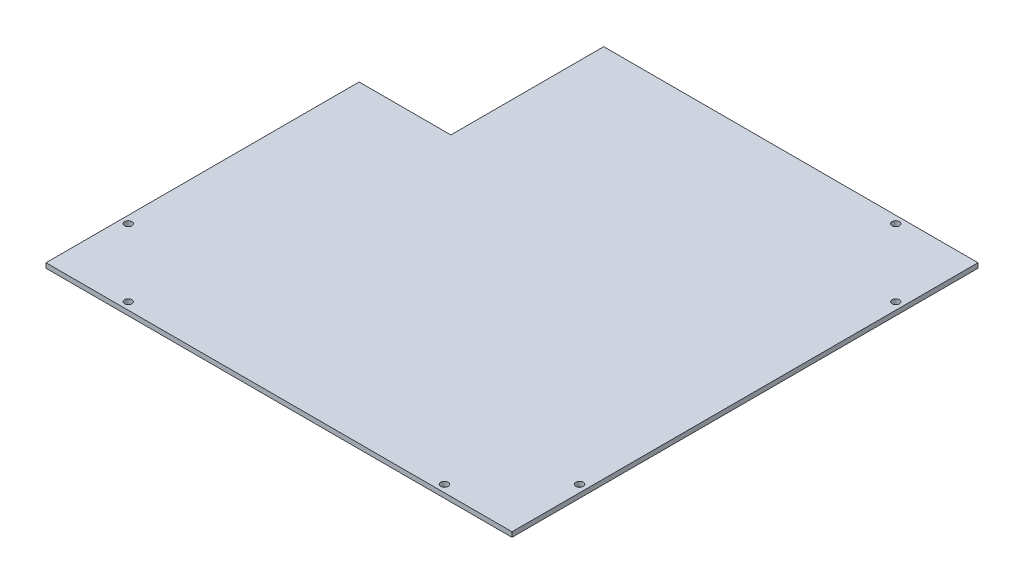
ISO-10303-21;
HEADER;
FILE_DESCRIPTION(('STEP AP214'),'2;1');
FILE_NAME('part.step','',(''),(''),'','','');
FILE_SCHEMA(('AUTOMOTIVE_DESIGN { 1 0 10303 214 1 1 1 1 }'));
ENDSEC;
DATA;
#1=APPLICATION_CONTEXT('core data for automotive mechanical design processes');
#2=APPLICATION_PROTOCOL_DEFINITION('international standard','automotive_design',2000,#1);
#3=PRODUCT_CONTEXT('',#1,'mechanical');
#4=PRODUCT('Part','Part','',(#3));
#5=PRODUCT_RELATED_PRODUCT_CATEGORY('part','',(#4));
#6=PRODUCT_DEFINITION_FORMATION('','',#4);
#7=PRODUCT_DEFINITION_CONTEXT('part definition',#1,'design');
#8=PRODUCT_DEFINITION('design','',#6,#7);
#9=PRODUCT_DEFINITION_SHAPE('','',#8);
#10=(LENGTH_UNIT() NAMED_UNIT(*) SI_UNIT(.MILLI.,.METRE.));
#11=(NAMED_UNIT(*) PLANE_ANGLE_UNIT() SI_UNIT($,.RADIAN.));
#12=(NAMED_UNIT(*) SI_UNIT($,.STERADIAN.) SOLID_ANGLE_UNIT());
#13=UNCERTAINTY_MEASURE_WITH_UNIT(LENGTH_MEASURE(1.E-05),#10,'distance_accuracy_value','');
#14=(GEOMETRIC_REPRESENTATION_CONTEXT(3) GLOBAL_UNCERTAINTY_ASSIGNED_CONTEXT((#13)) GLOBAL_UNIT_ASSIGNED_CONTEXT((#10,
#11,#12)) REPRESENTATION_CONTEXT('',''));
#15=CARTESIAN_POINT('',(0.,0.,0.));
#16=DIRECTION('',(0.,0.,1.));
#17=DIRECTION('',(1.,0.,0.));
#18=AXIS2_PLACEMENT_3D('',#15,#16,#17);
#19=CARTESIAN_POINT('',(0.,1.5748,0.));
#20=DIRECTION('',(0.,-1.,0.));
#21=DIRECTION('',(0.,0.,-1.));
#22=AXIS2_PLACEMENT_3D('',#19,#20,#21);
#23=PLANE('',#22);
#24=CARTESIAN_POINT('',(-51.7,1.5748,73.8));
#25=DIRECTION('',(0.,1.,0.));
#26=DIRECTION('',(0.,0.,1.));
#27=AXIS2_PLACEMENT_3D('',#24,#25,#26);
#28=CIRCLE('',#27,1.2);
#29=CARTESIAN_POINT('',(-51.7,1.5748,75.));
#30=VERTEX_POINT('',#29);
#31=EDGE_CURVE('E129',#30,#30,#28,.T.);
#32=ORIENTED_EDGE('',*,*,#31,.F.);
#33=EDGE_LOOP('',(#32));
#34=FACE_BOUND('',#33,.T.);
#35=CARTESIAN_POINT('',(-73.8,1.5748,51.7));
#36=DIRECTION('',(0.,1.,0.));
#37=DIRECTION('',(0.,0.,1.));
#38=AXIS2_PLACEMENT_3D('',#35,#36,#37);
#39=CIRCLE('',#38,1.2);
#40=CARTESIAN_POINT('',(-73.8,1.5748,52.9));
#41=VERTEX_POINT('',#40);
#42=EDGE_CURVE('E135',#41,#41,#39,.T.);
#43=ORIENTED_EDGE('',*,*,#42,.F.);
#44=EDGE_LOOP('',(#43));
#45=FACE_BOUND('',#44,.T.);
#46=CARTESIAN_POINT('',(73.8,1.5748,-51.7));
#47=DIRECTION('',(0.,1.,0.));
#48=DIRECTION('',(0.,0.,1.));
#49=AXIS2_PLACEMENT_3D('',#46,#47,#48);
#50=CIRCLE('',#49,1.2);
#51=CARTESIAN_POINT('',(73.8,1.5748,-50.5));
#52=VERTEX_POINT('',#51);
#53=EDGE_CURVE('E147',#52,#52,#50,.T.);
#54=ORIENTED_EDGE('',*,*,#53,.F.);
#55=EDGE_LOOP('',(#54));
#56=FACE_BOUND('',#55,.T.);
#57=DIRECTION('',(-1.,0.,0.));
#58=VECTOR('',#57,1.);
#59=CARTESIAN_POINT('',(-76.2,1.5748,-76.2));
#60=LINE('',#59,#58);
#61=CARTESIAN_POINT('',(76.2,1.5748,-76.2));
#62=VERTEX_POINT('',#61);
#63=CARTESIAN_POINT('',(-46.2,1.5748,-76.2));
#64=VERTEX_POINT('',#63);
#65=EDGE_CURVE('E81',#62,#64,#60,.T.);
#66=ORIENTED_EDGE('',*,*,#65,.T.);
#67=DIRECTION('',(0.,0.,-1.));
#68=VECTOR('',#67,1.);
#69=CARTESIAN_POINT('',(-46.2,1.5748,-76.2));
#70=LINE('',#69,#68);
#71=CARTESIAN_POINT('',(-46.2,1.5748,-26.2));
#72=VERTEX_POINT('',#71);
#73=EDGE_CURVE('E115',#72,#64,#70,.T.);
#74=ORIENTED_EDGE('',*,*,#73,.F.);
#75=DIRECTION('',(1.,0.,0.));
#76=VECTOR('',#75,1.);
#77=CARTESIAN_POINT('',(-76.2,1.5748,-26.2));
#78=LINE('',#77,#76);
#79=CARTESIAN_POINT('',(-76.2,1.5748,-26.2));
#80=VERTEX_POINT('',#79);
#81=EDGE_CURVE('E99',#80,#72,#78,.T.);
#82=ORIENTED_EDGE('',*,*,#81,.F.);
#83=DIRECTION('',(0.,0.,1.));
#84=VECTOR('',#83,1.);
#85=CARTESIAN_POINT('',(-76.2,1.5748,76.2));
#86=LINE('',#85,#84);
#87=CARTESIAN_POINT('',(-76.2,1.5748,76.2));
#88=VERTEX_POINT('',#87);
#89=EDGE_CURVE('E162',#80,#88,#86,.T.);
#90=ORIENTED_EDGE('',*,*,#89,.T.);
#91=DIRECTION('',(1.,0.,0.));
#92=VECTOR('',#91,1.);
#93=CARTESIAN_POINT('',(-76.2,1.5748,76.2));
#94=LINE('',#93,#92);
#95=CARTESIAN_POINT('',(76.2,1.5748,76.2));
#96=VERTEX_POINT('',#95);
#97=EDGE_CURVE('E58',#88,#96,#94,.T.);
#98=ORIENTED_EDGE('',*,*,#97,.T.);
#99=DIRECTION('',(0.,0.,-1.));
#100=VECTOR('',#99,1.);
#101=CARTESIAN_POINT('',(76.2,1.5748,76.2));
#102=LINE('',#101,#100);
#103=EDGE_CURVE('E159',#96,#62,#102,.T.);
#104=ORIENTED_EDGE('',*,*,#103,.T.);
#105=EDGE_LOOP('',(#66,#74,#82,#90,#98,#104));
#106=FACE_BOUND('',#105,.T.);
#107=CARTESIAN_POINT('',(51.7,1.5748,-73.8));
#108=DIRECTION('',(0.,1.,0.));
#109=DIRECTION('',(0.,0.,1.));
#110=AXIS2_PLACEMENT_3D('',#107,#108,#109);
#111=CIRCLE('',#110,1.2);
#112=CARTESIAN_POINT('',(51.7,1.5748,-72.6));
#113=VERTEX_POINT('',#112);
#114=EDGE_CURVE('E153',#113,#113,#111,.T.);
#115=ORIENTED_EDGE('',*,*,#114,.F.);
#116=EDGE_LOOP('',(#115));
#117=FACE_BOUND('',#116,.T.);
#118=CARTESIAN_POINT('',(73.8,1.5748,51.7));
#119=DIRECTION('',(0.,1.,0.));
#120=DIRECTION('',(0.,0.,1.));
#121=AXIS2_PLACEMENT_3D('',#118,#119,#120);
#122=CIRCLE('',#121,1.2);
#123=CARTESIAN_POINT('',(73.8,1.5748,52.9));
#124=VERTEX_POINT('',#123);
#125=EDGE_CURVE('E141',#124,#124,#122,.T.);
#126=ORIENTED_EDGE('',*,*,#125,.F.);
#127=EDGE_LOOP('',(#126));
#128=FACE_BOUND('',#127,.T.);
#129=CARTESIAN_POINT('',(51.7,1.5748,73.8));
#130=DIRECTION('',(0.,1.,0.));
#131=DIRECTION('',(0.,0.,1.));
#132=AXIS2_PLACEMENT_3D('',#129,#130,#131);
#133=CIRCLE('',#132,1.2);
#134=CARTESIAN_POINT('',(51.7,1.5748,75.));
#135=VERTEX_POINT('',#134);
#136=EDGE_CURVE('E123',#135,#135,#133,.T.);
#137=ORIENTED_EDGE('',*,*,#136,.F.);
#138=EDGE_LOOP('',(#137));
#139=FACE_BOUND('',#138,.T.);
#140=ADVANCED_FACE('F34',(#34,#45,#56,#106,#117,#128,#139),#23,.F.);
#141=CARTESIAN_POINT('',(0.,0.,0.));
#142=DIRECTION('',(0.,-1.,0.));
#143=DIRECTION('',(0.,0.,-1.));
#144=AXIS2_PLACEMENT_3D('',#141,#142,#143);
#145=PLANE('',#144);
#146=DIRECTION('',(0.,0.,-1.));
#147=VECTOR('',#146,1.);
#148=CARTESIAN_POINT('',(-46.2,0.,-76.2));
#149=LINE('',#148,#147);
#150=CARTESIAN_POINT('',(-46.2,0.,-26.2));
#151=VERTEX_POINT('',#150);
#152=CARTESIAN_POINT('',(-46.2,0.,-76.2));
#153=VERTEX_POINT('',#152);
#154=EDGE_CURVE('E106',#151,#153,#149,.T.);
#155=ORIENTED_EDGE('',*,*,#154,.T.);
#156=DIRECTION('',(-1.,0.,0.));
#157=VECTOR('',#156,1.);
#158=CARTESIAN_POINT('',(-76.2,0.,-76.2));
#159=LINE('',#158,#157);
#160=CARTESIAN_POINT('',(76.2,0.,-76.2));
#161=VERTEX_POINT('',#160);
#162=EDGE_CURVE('E168',#161,#153,#159,.T.);
#163=ORIENTED_EDGE('',*,*,#162,.F.);
#164=DIRECTION('',(0.,0.,-1.));
#165=VECTOR('',#164,1.);
#166=CARTESIAN_POINT('',(76.2,0.,76.2));
#167=LINE('',#166,#165);
#168=CARTESIAN_POINT('',(76.2,0.,76.2));
#169=VERTEX_POINT('',#168);
#170=EDGE_CURVE('E156',#169,#161,#167,.T.);
#171=ORIENTED_EDGE('',*,*,#170,.F.);
#172=DIRECTION('',(1.,0.,0.));
#173=VECTOR('',#172,1.);
#174=CARTESIAN_POINT('',(-76.2,0.,76.2));
#175=LINE('',#174,#173);
#176=CARTESIAN_POINT('',(-76.2,0.,76.2));
#177=VERTEX_POINT('',#176);
#178=EDGE_CURVE('E75',#177,#169,#175,.T.);
#179=ORIENTED_EDGE('',*,*,#178,.F.);
#180=DIRECTION('',(0.,0.,1.));
#181=VECTOR('',#180,1.);
#182=CARTESIAN_POINT('',(-76.2,0.,76.2));
#183=LINE('',#182,#181);
#184=CARTESIAN_POINT('',(-76.2,0.,-26.2));
#185=VERTEX_POINT('',#184);
#186=EDGE_CURVE('E114',#185,#177,#183,.T.);
#187=ORIENTED_EDGE('',*,*,#186,.F.);
#188=DIRECTION('',(1.,0.,0.));
#189=VECTOR('',#188,1.);
#190=CARTESIAN_POINT('',(-76.2,0.,-26.2));
#191=LINE('',#190,#189);
#192=EDGE_CURVE('E49',#185,#151,#191,.T.);
#193=ORIENTED_EDGE('',*,*,#192,.T.);
#194=EDGE_LOOP('',(#155,#163,#171,#179,#187,#193));
#195=FACE_BOUND('',#194,.T.);
#196=CARTESIAN_POINT('',(-51.7,0.,73.8));
#197=DIRECTION('',(0.,1.,0.));
#198=DIRECTION('',(0.,0.,1.));
#199=AXIS2_PLACEMENT_3D('',#196,#197,#198);
#200=CIRCLE('',#199,1.2);
#201=CARTESIAN_POINT('',(-51.7,0.,75.));
#202=VERTEX_POINT('',#201);
#203=EDGE_CURVE('E126',#202,#202,#200,.T.);
#204=ORIENTED_EDGE('',*,*,#203,.T.);
#205=EDGE_LOOP('',(#204));
#206=FACE_BOUND('',#205,.T.);
#207=CARTESIAN_POINT('',(-73.8,0.,51.7));
#208=DIRECTION('',(0.,1.,0.));
#209=DIRECTION('',(0.,0.,1.));
#210=AXIS2_PLACEMENT_3D('',#207,#208,#209);
#211=CIRCLE('',#210,1.2);
#212=CARTESIAN_POINT('',(-73.8,0.,52.9));
#213=VERTEX_POINT('',#212);
#214=EDGE_CURVE('E132',#213,#213,#211,.T.);
#215=ORIENTED_EDGE('',*,*,#214,.T.);
#216=EDGE_LOOP('',(#215));
#217=FACE_BOUND('',#216,.T.);
#218=CARTESIAN_POINT('',(73.8,0.,-51.7));
#219=DIRECTION('',(0.,1.,0.));
#220=DIRECTION('',(0.,0.,1.));
#221=AXIS2_PLACEMENT_3D('',#218,#219,#220);
#222=CIRCLE('',#221,1.2);
#223=CARTESIAN_POINT('',(73.8,0.,-50.5));
#224=VERTEX_POINT('',#223);
#225=EDGE_CURVE('E144',#224,#224,#222,.T.);
#226=ORIENTED_EDGE('',*,*,#225,.T.);
#227=EDGE_LOOP('',(#226));
#228=FACE_BOUND('',#227,.T.);
#229=CARTESIAN_POINT('',(51.7,0.,-73.8));
#230=DIRECTION('',(0.,1.,0.));
#231=DIRECTION('',(0.,0.,1.));
#232=AXIS2_PLACEMENT_3D('',#229,#230,#231);
#233=CIRCLE('',#232,1.2);
#234=CARTESIAN_POINT('',(51.7,0.,-72.6));
#235=VERTEX_POINT('',#234);
#236=EDGE_CURVE('E150',#235,#235,#233,.T.);
#237=ORIENTED_EDGE('',*,*,#236,.T.);
#238=EDGE_LOOP('',(#237));
#239=FACE_BOUND('',#238,.T.);
#240=CARTESIAN_POINT('',(73.8,0.,51.7));
#241=DIRECTION('',(0.,1.,0.));
#242=DIRECTION('',(0.,0.,1.));
#243=AXIS2_PLACEMENT_3D('',#240,#241,#242);
#244=CIRCLE('',#243,1.2);
#245=CARTESIAN_POINT('',(73.8,0.,52.9));
#246=VERTEX_POINT('',#245);
#247=EDGE_CURVE('E138',#246,#246,#244,.T.);
#248=ORIENTED_EDGE('',*,*,#247,.T.);
#249=EDGE_LOOP('',(#248));
#250=FACE_BOUND('',#249,.T.);
#251=CARTESIAN_POINT('',(51.7,0.,73.8));
#252=DIRECTION('',(0.,1.,0.));
#253=DIRECTION('',(0.,0.,1.));
#254=AXIS2_PLACEMENT_3D('',#251,#252,#253);
#255=CIRCLE('',#254,1.2);
#256=CARTESIAN_POINT('',(51.7,0.,75.));
#257=VERTEX_POINT('',#256);
#258=EDGE_CURVE('E120',#257,#257,#255,.T.);
#259=ORIENTED_EDGE('',*,*,#258,.T.);
#260=EDGE_LOOP('',(#259));
#261=FACE_BOUND('',#260,.T.);
#262=ADVANCED_FACE('F112',(#195,#206,#217,#228,#239,#250,#261),#145,.T.);
#263=CARTESIAN_POINT('',(76.2,1.5748,76.2));
#264=DIRECTION('',(-1.,0.,0.));
#265=DIRECTION('',(0.,0.,1.));
#266=AXIS2_PLACEMENT_3D('',#263,#264,#265);
#267=PLANE('',#266);
#268=ORIENTED_EDGE('',*,*,#170,.T.);
#269=DIRECTION('',(0.,-1.,0.));
#270=VECTOR('',#269,1.);
#271=CARTESIAN_POINT('',(76.2,1.5748,-76.2));
#272=LINE('',#271,#270);
#273=EDGE_CURVE('E11',#62,#161,#272,.T.);
#274=ORIENTED_EDGE('',*,*,#273,.F.);
#275=ORIENTED_EDGE('',*,*,#103,.F.);
#276=DIRECTION('',(0.,-1.,0.));
#277=VECTOR('',#276,1.);
#278=CARTESIAN_POINT('',(76.2,1.5748,76.2));
#279=LINE('',#278,#277);
#280=EDGE_CURVE('E165',#96,#169,#279,.T.);
#281=ORIENTED_EDGE('',*,*,#280,.T.);
#282=EDGE_LOOP('',(#268,#274,#275,#281));
#283=FACE_BOUND('',#282,.T.);
#284=ADVANCED_FACE('F36',(#283),#267,.F.);
#285=CARTESIAN_POINT('',(-76.2,1.5748,-76.2));
#286=DIRECTION('',(0.,0.,1.));
#287=DIRECTION('',(1.,0.,0.));
#288=AXIS2_PLACEMENT_3D('',#285,#286,#287);
#289=PLANE('',#288);
#290=ORIENTED_EDGE('',*,*,#162,.T.);
#291=DIRECTION('',(0.,1.,0.));
#292=VECTOR('',#291,1.);
#293=CARTESIAN_POINT('',(-46.2,0.,-76.2));
#294=LINE('',#293,#292);
#295=EDGE_CURVE('E102',#153,#64,#294,.T.);
#296=ORIENTED_EDGE('',*,*,#295,.T.);
#297=ORIENTED_EDGE('',*,*,#65,.F.);
#298=ORIENTED_EDGE('',*,*,#273,.T.);
#299=EDGE_LOOP('',(#290,#296,#297,#298));
#300=FACE_BOUND('',#299,.T.);
#301=ADVANCED_FACE('F181',(#300),#289,.F.);
#302=CARTESIAN_POINT('',(-76.2,1.5748,76.2));
#303=DIRECTION('',(1.,0.,0.));
#304=DIRECTION('',(0.,0.,-1.));
#305=AXIS2_PLACEMENT_3D('',#302,#303,#304);
#306=PLANE('',#305);
#307=ORIENTED_EDGE('',*,*,#89,.F.);
#308=DIRECTION('',(0.,1.,0.));
#309=VECTOR('',#308,1.);
#310=CARTESIAN_POINT('',(-76.2,0.,-26.2));
#311=LINE('',#310,#309);
#312=EDGE_CURVE('E103',#185,#80,#311,.T.);
#313=ORIENTED_EDGE('',*,*,#312,.F.);
#314=ORIENTED_EDGE('',*,*,#186,.T.);
#315=DIRECTION('',(0.,-1.,0.));
#316=VECTOR('',#315,1.);
#317=CARTESIAN_POINT('',(-76.2,1.5748,76.2));
#318=LINE('',#317,#316);
#319=EDGE_CURVE('E42',#88,#177,#318,.T.);
#320=ORIENTED_EDGE('',*,*,#319,.F.);
#321=EDGE_LOOP('',(#307,#313,#314,#320));
#322=FACE_BOUND('',#321,.T.);
#323=ADVANCED_FACE('F183',(#322),#306,.F.);
#324=CARTESIAN_POINT('',(-76.2,1.5748,76.2));
#325=DIRECTION('',(0.,0.,-1.));
#326=DIRECTION('',(-1.,0.,0.));
#327=AXIS2_PLACEMENT_3D('',#324,#325,#326);
#328=PLANE('',#327);
#329=ORIENTED_EDGE('',*,*,#178,.T.);
#330=ORIENTED_EDGE('',*,*,#280,.F.);
#331=ORIENTED_EDGE('',*,*,#97,.F.);
#332=ORIENTED_EDGE('',*,*,#319,.T.);
#333=EDGE_LOOP('',(#329,#330,#331,#332));
#334=FACE_BOUND('',#333,.T.);
#335=ADVANCED_FACE('F173',(#334),#328,.F.);
#336=CARTESIAN_POINT('',(51.7,1.5748,-73.8));
#337=DIRECTION('',(0.,-1.,0.));
#338=DIRECTION('',(0.,0.,-1.));
#339=AXIS2_PLACEMENT_3D('',#336,#337,#338);
#340=CYLINDRICAL_SURFACE('',#339,1.2);
#341=ORIENTED_EDGE('',*,*,#114,.T.);
#342=EDGE_LOOP('',(#341));
#343=FACE_BOUND('',#342,.T.);
#344=ORIENTED_EDGE('',*,*,#236,.F.);
#345=EDGE_LOOP('',(#344));
#346=FACE_BOUND('',#345,.T.);
#347=ADVANCED_FACE('F200',(#343,#346),#340,.F.);
#348=CARTESIAN_POINT('',(73.8,1.5748,-51.7));
#349=DIRECTION('',(0.,-1.,0.));
#350=DIRECTION('',(0.,0.,-1.));
#351=AXIS2_PLACEMENT_3D('',#348,#349,#350);
#352=CYLINDRICAL_SURFACE('',#351,1.2);
#353=ORIENTED_EDGE('',*,*,#53,.T.);
#354=EDGE_LOOP('',(#353));
#355=FACE_BOUND('',#354,.T.);
#356=ORIENTED_EDGE('',*,*,#225,.F.);
#357=EDGE_LOOP('',(#356));
#358=FACE_BOUND('',#357,.T.);
#359=ADVANCED_FACE('F208',(#355,#358),#352,.F.);
#360=CARTESIAN_POINT('',(73.8,1.5748,51.7));
#361=DIRECTION('',(0.,-1.,0.));
#362=DIRECTION('',(0.,0.,-1.));
#363=AXIS2_PLACEMENT_3D('',#360,#361,#362);
#364=CYLINDRICAL_SURFACE('',#363,1.2);
#365=ORIENTED_EDGE('',*,*,#125,.T.);
#366=EDGE_LOOP('',(#365));
#367=FACE_BOUND('',#366,.T.);
#368=ORIENTED_EDGE('',*,*,#247,.F.);
#369=EDGE_LOOP('',(#368));
#370=FACE_BOUND('',#369,.T.);
#371=ADVANCED_FACE('F213',(#367,#370),#364,.F.);
#372=CARTESIAN_POINT('',(-73.8,1.5748,51.7));
#373=DIRECTION('',(0.,-1.,0.));
#374=DIRECTION('',(0.,0.,-1.));
#375=AXIS2_PLACEMENT_3D('',#372,#373,#374);
#376=CYLINDRICAL_SURFACE('',#375,1.2);
#377=ORIENTED_EDGE('',*,*,#42,.T.);
#378=EDGE_LOOP('',(#377));
#379=FACE_BOUND('',#378,.T.);
#380=ORIENTED_EDGE('',*,*,#214,.F.);
#381=EDGE_LOOP('',(#380));
#382=FACE_BOUND('',#381,.T.);
#383=ADVANCED_FACE('F233',(#379,#382),#376,.F.);
#384=CARTESIAN_POINT('',(-51.7,1.5748,73.8));
#385=DIRECTION('',(0.,-1.,0.));
#386=DIRECTION('',(0.,0.,-1.));
#387=AXIS2_PLACEMENT_3D('',#384,#385,#386);
#388=CYLINDRICAL_SURFACE('',#387,1.2);
#389=ORIENTED_EDGE('',*,*,#31,.T.);
#390=EDGE_LOOP('',(#389));
#391=FACE_BOUND('',#390,.T.);
#392=ORIENTED_EDGE('',*,*,#203,.F.);
#393=EDGE_LOOP('',(#392));
#394=FACE_BOUND('',#393,.T.);
#395=ADVANCED_FACE('F226',(#391,#394),#388,.F.);
#396=CARTESIAN_POINT('',(51.7,1.5748,73.8));
#397=DIRECTION('',(0.,-1.,0.));
#398=DIRECTION('',(0.,0.,-1.));
#399=AXIS2_PLACEMENT_3D('',#396,#397,#398);
#400=CYLINDRICAL_SURFACE('',#399,1.2);
#401=ORIENTED_EDGE('',*,*,#136,.T.);
#402=EDGE_LOOP('',(#401));
#403=FACE_BOUND('',#402,.T.);
#404=ORIENTED_EDGE('',*,*,#258,.F.);
#405=EDGE_LOOP('',(#404));
#406=FACE_BOUND('',#405,.T.);
#407=ADVANCED_FACE('F224',(#403,#406),#400,.F.);
#408=CARTESIAN_POINT('',(-46.2,0.,-76.2));
#409=DIRECTION('',(1.,0.,0.));
#410=DIRECTION('',(0.,0.,-1.));
#411=AXIS2_PLACEMENT_3D('',#408,#409,#410);
#412=PLANE('',#411);
#413=ORIENTED_EDGE('',*,*,#73,.T.);
#414=ORIENTED_EDGE('',*,*,#295,.F.);
#415=ORIENTED_EDGE('',*,*,#154,.F.);
#416=DIRECTION('',(0.,1.,0.));
#417=VECTOR('',#416,1.);
#418=CARTESIAN_POINT('',(-46.2,0.,-26.2));
#419=LINE('',#418,#417);
#420=EDGE_CURVE('E95',#151,#72,#419,.T.);
#421=ORIENTED_EDGE('',*,*,#420,.T.);
#422=EDGE_LOOP('',(#413,#414,#415,#421));
#423=FACE_BOUND('',#422,.T.);
#424=ADVANCED_FACE('F107',(#423),#412,.F.);
#425=CARTESIAN_POINT('',(-76.2,0.,-26.2));
#426=DIRECTION('',(0.,0.,1.));
#427=DIRECTION('',(1.,0.,0.));
#428=AXIS2_PLACEMENT_3D('',#425,#426,#427);
#429=PLANE('',#428);
#430=ORIENTED_EDGE('',*,*,#81,.T.);
#431=ORIENTED_EDGE('',*,*,#420,.F.);
#432=ORIENTED_EDGE('',*,*,#192,.F.);
#433=ORIENTED_EDGE('',*,*,#312,.T.);
#434=EDGE_LOOP('',(#430,#431,#432,#433));
#435=FACE_BOUND('',#434,.T.);
#436=ADVANCED_FACE('F97',(#435),#429,.F.);
#437=CLOSED_SHELL('',(#140,#262,#284,#301,#323,#335,#347,#359,#371,#383,#395,#407,#424,#436));
#438=MANIFOLD_SOLID_BREP('B2',#437);
#439=ADVANCED_BREP_SHAPE_REPRESENTATION('',(#18,#438),#14);
#440=SHAPE_DEFINITION_REPRESENTATION(#9,#439);
ENDSEC;
END-ISO-10303-21;
